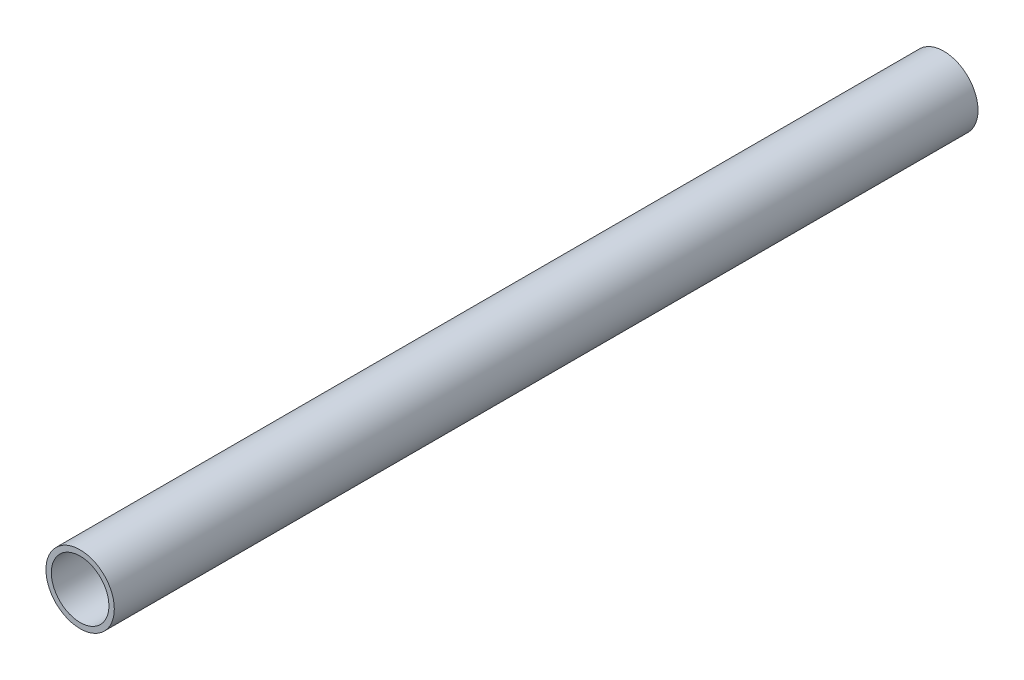
ISO-10303-21;
HEADER;
FILE_DESCRIPTION(('STEP AP214'),'2;1');
FILE_NAME('part.step','',(''),(''),'','','');
FILE_SCHEMA(('AUTOMOTIVE_DESIGN { 1 0 10303 214 1 1 1 1 }'));
ENDSEC;
DATA;
#1=APPLICATION_CONTEXT('core data for automotive mechanical design processes');
#2=APPLICATION_PROTOCOL_DEFINITION('international standard','automotive_design',2000,#1);
#3=PRODUCT_CONTEXT('',#1,'mechanical');
#4=PRODUCT('Part','Part','',(#3));
#5=PRODUCT_RELATED_PRODUCT_CATEGORY('part','',(#4));
#6=PRODUCT_DEFINITION_FORMATION('','',#4);
#7=PRODUCT_DEFINITION_CONTEXT('part definition',#1,'design');
#8=PRODUCT_DEFINITION('design','',#6,#7);
#9=PRODUCT_DEFINITION_SHAPE('','',#8);
#10=(LENGTH_UNIT() NAMED_UNIT(*) SI_UNIT(.MILLI.,.METRE.));
#11=(NAMED_UNIT(*) PLANE_ANGLE_UNIT() SI_UNIT($,.RADIAN.));
#12=(NAMED_UNIT(*) SI_UNIT($,.STERADIAN.) SOLID_ANGLE_UNIT());
#13=UNCERTAINTY_MEASURE_WITH_UNIT(LENGTH_MEASURE(1.E-05),#10,'distance_accuracy_value','');
#14=(GEOMETRIC_REPRESENTATION_CONTEXT(3) GLOBAL_UNCERTAINTY_ASSIGNED_CONTEXT((#13)) GLOBAL_UNIT_ASSIGNED_CONTEXT((#10,
#11,#12)) REPRESENTATION_CONTEXT('',''));
#15=CARTESIAN_POINT('',(0.,0.,0.));
#16=DIRECTION('',(0.,0.,1.));
#17=DIRECTION('',(1.,0.,0.));
#18=AXIS2_PLACEMENT_3D('',#15,#16,#17);
#19=CARTESIAN_POINT('',(0.,0.,381.));
#20=DIRECTION('',(0.,0.,1.));
#21=DIRECTION('',(1.,0.,0.));
#22=AXIS2_PLACEMENT_3D('',#19,#20,#21);
#23=PLANE('',#22);
#24=CARTESIAN_POINT('',(0.,0.,381.));
#25=DIRECTION('',(0.,0.,1.));
#26=DIRECTION('',(1.,0.,0.));
#27=AXIS2_PLACEMENT_3D('',#24,#25,#26);
#28=CIRCLE('',#27,15.08125);
#29=CARTESIAN_POINT('',(15.08125,0.,381.));
#30=VERTEX_POINT('',#29);
#31=EDGE_CURVE('E10',#30,#30,#28,.T.);
#32=ORIENTED_EDGE('',*,*,#31,.T.);
#33=EDGE_LOOP('',(#32));
#34=FACE_BOUND('',#33,.T.);
#35=CARTESIAN_POINT('',(0.,0.,381.));
#36=DIRECTION('',(0.,0.,1.));
#37=DIRECTION('',(1.,0.,0.));
#38=AXIS2_PLACEMENT_3D('',#35,#36,#37);
#39=CIRCLE('',#38,12.7);
#40=CARTESIAN_POINT('',(12.7,0.,381.));
#41=VERTEX_POINT('',#40);
#42=EDGE_CURVE('E42',#41,#41,#39,.T.);
#43=ORIENTED_EDGE('',*,*,#42,.F.);
#44=EDGE_LOOP('',(#43));
#45=FACE_BOUND('',#44,.T.);
#46=ADVANCED_FACE('F31',(#34,#45),#23,.T.);
#47=CARTESIAN_POINT('',(0.,0.,0.));
#48=DIRECTION('',(0.,0.,1.));
#49=DIRECTION('',(1.,0.,0.));
#50=AXIS2_PLACEMENT_3D('',#47,#48,#49);
#51=PLANE('',#50);
#52=CARTESIAN_POINT('',(0.,0.,0.));
#53=DIRECTION('',(0.,0.,1.));
#54=DIRECTION('',(1.,0.,0.));
#55=AXIS2_PLACEMENT_3D('',#52,#53,#54);
#56=CIRCLE('',#55,15.08125);
#57=CARTESIAN_POINT('',(15.08125,0.,0.));
#58=VERTEX_POINT('',#57);
#59=EDGE_CURVE('E35',#58,#58,#56,.T.);
#60=ORIENTED_EDGE('',*,*,#59,.F.);
#61=EDGE_LOOP('',(#60));
#62=FACE_BOUND('',#61,.T.);
#63=CARTESIAN_POINT('',(0.,0.,0.));
#64=DIRECTION('',(0.,0.,1.));
#65=DIRECTION('',(1.,0.,0.));
#66=AXIS2_PLACEMENT_3D('',#63,#64,#65);
#67=CIRCLE('',#66,12.7);
#68=CARTESIAN_POINT('',(12.7,0.,0.));
#69=VERTEX_POINT('',#68);
#70=EDGE_CURVE('E44',#69,#69,#67,.T.);
#71=ORIENTED_EDGE('',*,*,#70,.T.);
#72=EDGE_LOOP('',(#71));
#73=FACE_BOUND('',#72,.T.);
#74=ADVANCED_FACE('F54',(#62,#73),#51,.F.);
#75=CARTESIAN_POINT('',(0.,0.,381.));
#76=DIRECTION('',(0.,0.,-1.));
#77=DIRECTION('',(-1.,0.,0.));
#78=AXIS2_PLACEMENT_3D('',#75,#76,#77);
#79=CYLINDRICAL_SURFACE('',#78,15.08125);
#80=ORIENTED_EDGE('',*,*,#31,.F.);
#81=EDGE_LOOP('',(#80));
#82=FACE_BOUND('',#81,.T.);
#83=ORIENTED_EDGE('',*,*,#59,.T.);
#84=EDGE_LOOP('',(#83));
#85=FACE_BOUND('',#84,.T.);
#86=ADVANCED_FACE('F33',(#82,#85),#79,.T.);
#87=CARTESIAN_POINT('',(0.,0.,381.));
#88=DIRECTION('',(0.,0.,-1.));
#89=DIRECTION('',(-1.,0.,0.));
#90=AXIS2_PLACEMENT_3D('',#87,#88,#89);
#91=CYLINDRICAL_SURFACE('',#90,12.7);
#92=ORIENTED_EDGE('',*,*,#42,.T.);
#93=EDGE_LOOP('',(#92));
#94=FACE_BOUND('',#93,.T.);
#95=ORIENTED_EDGE('',*,*,#70,.F.);
#96=EDGE_LOOP('',(#95));
#97=FACE_BOUND('',#96,.T.);
#98=ADVANCED_FACE('F50',(#94,#97),#91,.F.);
#99=CLOSED_SHELL('',(#46,#74,#86,#98));
#100=MANIFOLD_SOLID_BREP('B2',#99);
#101=ADVANCED_BREP_SHAPE_REPRESENTATION('',(#18,#100),#14);
#102=SHAPE_DEFINITION_REPRESENTATION(#9,#101);
ENDSEC;
END-ISO-10303-21;
